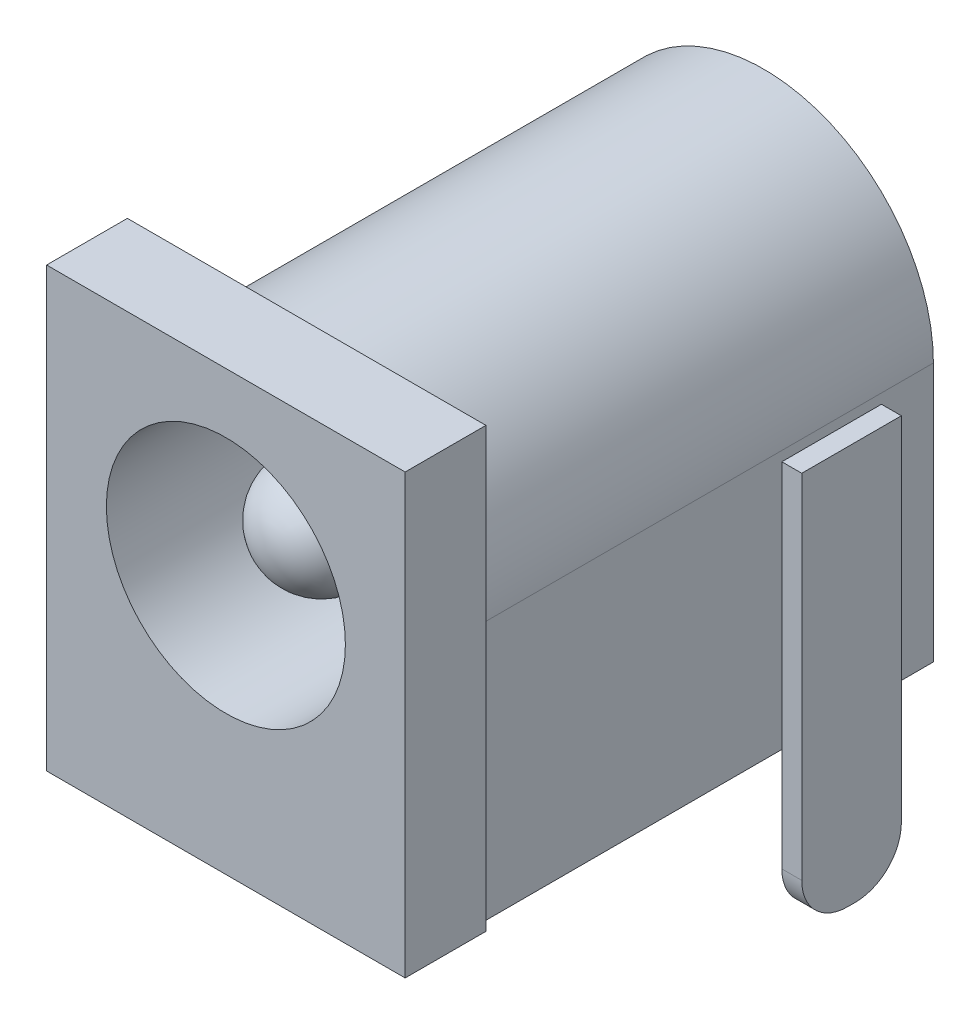
ISO-10303-21;
HEADER;
FILE_DESCRIPTION(('STEP AP214'),'2;1');
FILE_NAME('part.step','',(''),(''),'','','');
FILE_SCHEMA(('AUTOMOTIVE_DESIGN { 1 0 10303 214 1 1 1 1 }'));
ENDSEC;
DATA;
#1=APPLICATION_CONTEXT('core data for automotive mechanical design processes');
#2=APPLICATION_PROTOCOL_DEFINITION('international standard','automotive_design',2000,#1);
#3=PRODUCT_CONTEXT('',#1,'mechanical');
#4=PRODUCT('Part','Part','',(#3));
#5=PRODUCT_RELATED_PRODUCT_CATEGORY('part','',(#4));
#6=PRODUCT_DEFINITION_FORMATION('','',#4);
#7=PRODUCT_DEFINITION_CONTEXT('part definition',#1,'design');
#8=PRODUCT_DEFINITION('design','',#6,#7);
#9=PRODUCT_DEFINITION_SHAPE('','',#8);
#10=(LENGTH_UNIT() NAMED_UNIT(*) SI_UNIT(.MILLI.,.METRE.));
#11=(NAMED_UNIT(*) PLANE_ANGLE_UNIT() SI_UNIT($,.RADIAN.));
#12=(NAMED_UNIT(*) SI_UNIT($,.STERADIAN.) SOLID_ANGLE_UNIT());
#13=UNCERTAINTY_MEASURE_WITH_UNIT(LENGTH_MEASURE(1.E-05),#10,'distance_accuracy_value','');
#14=(GEOMETRIC_REPRESENTATION_CONTEXT(3) GLOBAL_UNCERTAINTY_ASSIGNED_CONTEXT((#13)) GLOBAL_UNIT_ASSIGNED_CONTEXT((#10,
#11,#12)) REPRESENTATION_CONTEXT('',''));
#15=CARTESIAN_POINT('',(0.,0.,0.));
#16=DIRECTION('',(0.,0.,1.));
#17=DIRECTION('',(1.,0.,0.));
#18=AXIS2_PLACEMENT_3D('',#15,#16,#17);
#19=CARTESIAN_POINT('',(9.50543642404111,6.5,1.55));
#20=DIRECTION('',(0.,0.,-1.));
#21=DIRECTION('',(-1.,0.,0.));
#22=AXIS2_PLACEMENT_3D('',#19,#20,#21);
#23=PLANE('',#22);
#24=DIRECTION('',(0.,-1.,0.));
#25=VECTOR('',#24,1.);
#26=CARTESIAN_POINT('',(9.50543642404111,6.5,1.55));
#27=LINE('',#26,#25);
#28=CARTESIAN_POINT('',(9.50543642404111,6.5,1.55));
#29=VERTEX_POINT('',#28);
#30=CARTESIAN_POINT('',(9.50543642404111,-2.35,1.55));
#31=VERTEX_POINT('',#30);
#32=EDGE_CURVE('E132',#29,#31,#27,.T.);
#33=ORIENTED_EDGE('',*,*,#32,.T.);
#34=DIRECTION('',(1.,0.,0.));
#35=VECTOR('',#34,1.);
#36=CARTESIAN_POINT('',(-0.00100000000000894,-2.35,1.55000000000001));
#37=LINE('',#36,#35);
#38=CARTESIAN_POINT('',(9.00543642404111,-2.35,1.55));
#39=VERTEX_POINT('',#38);
#40=EDGE_CURVE('E135',#39,#31,#37,.T.);
#41=ORIENTED_EDGE('',*,*,#40,.F.);
#42=DIRECTION('',(0.,-1.,0.));
#43=VECTOR('',#42,1.);
#44=CARTESIAN_POINT('',(9.00543642404111,6.5,1.55));
#45=LINE('',#44,#43);
#46=CARTESIAN_POINT('',(9.00543642404111,6.5,1.55));
#47=VERTEX_POINT('',#46);
#48=EDGE_CURVE('E47',#47,#39,#45,.T.);
#49=ORIENTED_EDGE('',*,*,#48,.F.);
#50=DIRECTION('',(1.,0.,0.));
#51=VECTOR('',#50,1.);
#52=CARTESIAN_POINT('',(9.50543642404111,6.5,1.55));
#53=LINE('',#52,#51);
#54=EDGE_CURVE('E122',#47,#29,#53,.T.);
#55=ORIENTED_EDGE('',*,*,#54,.T.);
#56=EDGE_LOOP('',(#33,#41,#49,#55));
#57=FACE_BOUND('',#56,.T.);
#58=ADVANCED_FACE('F43',(#57),#23,.T.);
#59=CARTESIAN_POINT('',(9.00543642404111,-3.5,1.55));
#60=DIRECTION('',(0.,1.,0.));
#61=DIRECTION('',(0.,0.,1.));
#62=AXIS2_PLACEMENT_3D('',#59,#60,#61);
#63=PLANE('',#62);
#64=DIRECTION('',(1.,0.,0.));
#65=VECTOR('',#64,1.);
#66=CARTESIAN_POINT('',(-0.00100000000000794,-3.5,2.7));
#67=LINE('',#66,#65);
#68=CARTESIAN_POINT('',(9.00543642404111,-3.5,2.7));
#69=VERTEX_POINT('',#68);
#70=CARTESIAN_POINT('',(9.50543642404111,-3.5,2.7));
#71=VERTEX_POINT('',#70);
#72=EDGE_CURVE('E96',#69,#71,#67,.T.);
#73=ORIENTED_EDGE('',*,*,#72,.T.);
#74=DIRECTION('',(0.,0.,1.));
#75=VECTOR('',#74,1.);
#76=CARTESIAN_POINT('',(9.50543642404111,-3.5,4.05));
#77=LINE('',#76,#75);
#78=CARTESIAN_POINT('',(9.50543642404111,-3.5,2.9));
#79=VERTEX_POINT('',#78);
#80=EDGE_CURVE('E113',#71,#79,#77,.T.);
#81=ORIENTED_EDGE('',*,*,#80,.T.);
#82=DIRECTION('',(1.,0.,0.));
#83=VECTOR('',#82,1.);
#84=CARTESIAN_POINT('',(-0.00100000000000794,-3.5,2.9));
#85=LINE('',#84,#83);
#86=CARTESIAN_POINT('',(9.00543642404111,-3.5,2.9));
#87=VERTEX_POINT('',#86);
#88=EDGE_CURVE('E104',#87,#79,#85,.T.);
#89=ORIENTED_EDGE('',*,*,#88,.F.);
#90=DIRECTION('',(0.,0.,-1.));
#91=VECTOR('',#90,1.);
#92=CARTESIAN_POINT('',(9.00543642404111,-3.5,4.05));
#93=LINE('',#92,#91);
#94=EDGE_CURVE('E109',#87,#69,#93,.T.);
#95=ORIENTED_EDGE('',*,*,#94,.T.);
#96=EDGE_LOOP('',(#73,#81,#89,#95));
#97=FACE_BOUND('',#96,.T.);
#98=ADVANCED_FACE('F112',(#97),#63,.F.);
#99=CARTESIAN_POINT('',(9.00543642404111,6.5,4.05));
#100=DIRECTION('',(-1.,0.,0.));
#101=DIRECTION('',(0.,0.,1.));
#102=AXIS2_PLACEMENT_3D('',#99,#100,#101);
#103=PLANE('',#102);
#104=CARTESIAN_POINT('',(9.00543642404111,-2.35,2.7));
#105=DIRECTION('',(-1.,0.,0.));
#106=DIRECTION('',(0.,0.,1.));
#107=AXIS2_PLACEMENT_3D('',#104,#105,#106);
#108=CIRCLE('',#107,1.15);
#109=EDGE_CURVE('E99',#39,#69,#108,.T.);
#110=ORIENTED_EDGE('',*,*,#109,.T.);
#111=ORIENTED_EDGE('',*,*,#94,.F.);
#112=CARTESIAN_POINT('',(9.00543642404111,-2.35,2.9));
#113=DIRECTION('',(-1.,0.,0.));
#114=DIRECTION('',(0.,0.,1.));
#115=AXIS2_PLACEMENT_3D('',#112,#113,#114);
#116=CIRCLE('',#115,1.15);
#117=CARTESIAN_POINT('',(9.00543642404111,-2.35,4.05));
#118=VERTEX_POINT('',#117);
#119=EDGE_CURVE('E68',#87,#118,#116,.T.);
#120=ORIENTED_EDGE('',*,*,#119,.T.);
#121=DIRECTION('',(0.,-1.,0.));
#122=VECTOR('',#121,1.);
#123=CARTESIAN_POINT('',(9.00543642404111,6.5,4.05));
#124=LINE('',#123,#122);
#125=CARTESIAN_POINT('',(9.00543642404111,6.5,4.05));
#126=VERTEX_POINT('',#125);
#127=EDGE_CURVE('E12',#126,#118,#124,.T.);
#128=ORIENTED_EDGE('',*,*,#127,.F.);
#129=DIRECTION('',(0.,0.,-1.));
#130=VECTOR('',#129,1.);
#131=CARTESIAN_POINT('',(9.00543642404111,6.5,4.05));
#132=LINE('',#131,#130);
#133=EDGE_CURVE('E116',#126,#47,#132,.T.);
#134=ORIENTED_EDGE('',*,*,#133,.T.);
#135=ORIENTED_EDGE('',*,*,#48,.T.);
#136=EDGE_LOOP('',(#110,#111,#120,#128,#134,#135));
#137=FACE_BOUND('',#136,.T.);
#138=ADVANCED_FACE('F45',(#137),#103,.T.);
#139=CARTESIAN_POINT('',(9.50543642404111,6.5,4.05));
#140=DIRECTION('',(0.,0.,1.));
#141=DIRECTION('',(1.,0.,0.));
#142=AXIS2_PLACEMENT_3D('',#139,#140,#141);
#143=PLANE('',#142);
#144=DIRECTION('',(1.,0.,0.));
#145=VECTOR('',#144,1.);
#146=CARTESIAN_POINT('',(-0.00100000000000395,-2.35,4.05000000000002));
#147=LINE('',#146,#145);
#148=CARTESIAN_POINT('',(9.50543642404111,-2.35,4.05));
#149=VERTEX_POINT('',#148);
#150=EDGE_CURVE('E147',#118,#149,#147,.T.);
#151=ORIENTED_EDGE('',*,*,#150,.T.);
#152=DIRECTION('',(0.,-1.,0.));
#153=VECTOR('',#152,1.);
#154=CARTESIAN_POINT('',(9.50543642404111,6.5,4.05));
#155=LINE('',#154,#153);
#156=CARTESIAN_POINT('',(9.50543642404111,6.5,4.05));
#157=VERTEX_POINT('',#156);
#158=EDGE_CURVE('E52',#157,#149,#155,.T.);
#159=ORIENTED_EDGE('',*,*,#158,.F.);
#160=DIRECTION('',(-1.,0.,0.));
#161=VECTOR('',#160,1.);
#162=CARTESIAN_POINT('',(9.50543642404111,6.5,4.05));
#163=LINE('',#162,#161);
#164=EDGE_CURVE('E128',#157,#126,#163,.T.);
#165=ORIENTED_EDGE('',*,*,#164,.T.);
#166=ORIENTED_EDGE('',*,*,#127,.T.);
#167=EDGE_LOOP('',(#151,#159,#165,#166));
#168=FACE_BOUND('',#167,.T.);
#169=ADVANCED_FACE('F146',(#168),#143,.T.);
#170=CARTESIAN_POINT('',(9.50543642404111,6.5,4.05));
#171=DIRECTION('',(1.,0.,0.));
#172=DIRECTION('',(0.,0.,-1.));
#173=AXIS2_PLACEMENT_3D('',#170,#171,#172);
#174=PLANE('',#173);
#175=CARTESIAN_POINT('',(9.50543642404111,-2.35,2.7));
#176=DIRECTION('',(-1.,0.,0.));
#177=DIRECTION('',(0.,0.,-1.));
#178=AXIS2_PLACEMENT_3D('',#175,#176,#177);
#179=CIRCLE('',#178,1.15);
#180=EDGE_CURVE('E60',#31,#71,#179,.T.);
#181=ORIENTED_EDGE('',*,*,#180,.F.);
#182=ORIENTED_EDGE('',*,*,#32,.F.);
#183=DIRECTION('',(0.,0.,1.));
#184=VECTOR('',#183,1.);
#185=CARTESIAN_POINT('',(9.50543642404111,6.5,4.05));
#186=LINE('',#185,#184);
#187=EDGE_CURVE('E125',#29,#157,#186,.T.);
#188=ORIENTED_EDGE('',*,*,#187,.T.);
#189=ORIENTED_EDGE('',*,*,#158,.T.);
#190=CARTESIAN_POINT('',(9.50543642404111,-2.35,2.9));
#191=DIRECTION('',(-1.,0.,0.));
#192=DIRECTION('',(0.,0.,-1.));
#193=AXIS2_PLACEMENT_3D('',#190,#191,#192);
#194=CIRCLE('',#193,1.15);
#195=EDGE_CURVE('E114',#79,#149,#194,.T.);
#196=ORIENTED_EDGE('',*,*,#195,.F.);
#197=ORIENTED_EDGE('',*,*,#80,.F.);
#198=EDGE_LOOP('',(#181,#182,#188,#189,#196,#197));
#199=FACE_BOUND('',#198,.T.);
#200=ADVANCED_FACE('F139',(#199),#174,.T.);
#201=CARTESIAN_POINT('',(9.00543642404111,6.5,1.55));
#202=DIRECTION('',(0.,1.,0.));
#203=DIRECTION('',(0.,0.,1.));
#204=AXIS2_PLACEMENT_3D('',#201,#202,#203);
#205=PLANE('',#204);
#206=ORIENTED_EDGE('',*,*,#133,.F.);
#207=ORIENTED_EDGE('',*,*,#164,.F.);
#208=ORIENTED_EDGE('',*,*,#187,.F.);
#209=ORIENTED_EDGE('',*,*,#54,.F.);
#210=EDGE_LOOP('',(#206,#207,#208,#209));
#211=FACE_BOUND('',#210,.T.);
#212=ADVANCED_FACE('F143',(#211),#205,.T.);
#213=CARTESIAN_POINT('',(-0.00100000000000794,-2.35,2.9));
#214=DIRECTION('',(1.,0.,0.));
#215=DIRECTION('',(0.,0.,-1.));
#216=AXIS2_PLACEMENT_3D('',#213,#214,#215);
#217=CYLINDRICAL_SURFACE('',#216,1.15);
#218=ORIENTED_EDGE('',*,*,#88,.T.);
#219=ORIENTED_EDGE('',*,*,#195,.T.);
#220=ORIENTED_EDGE('',*,*,#150,.F.);
#221=ORIENTED_EDGE('',*,*,#119,.F.);
#222=EDGE_LOOP('',(#218,#219,#220,#221));
#223=FACE_BOUND('',#222,.T.);
#224=ADVANCED_FACE('F149',(#223),#217,.T.);
#225=CARTESIAN_POINT('',(-0.00100000000000794,-2.35,2.7));
#226=DIRECTION('',(1.,0.,0.));
#227=DIRECTION('',(0.,0.,-1.));
#228=AXIS2_PLACEMENT_3D('',#225,#226,#227);
#229=CYLINDRICAL_SURFACE('',#228,1.15);
#230=ORIENTED_EDGE('',*,*,#40,.T.);
#231=ORIENTED_EDGE('',*,*,#180,.T.);
#232=ORIENTED_EDGE('',*,*,#72,.F.);
#233=ORIENTED_EDGE('',*,*,#109,.F.);
#234=EDGE_LOOP('',(#230,#231,#232,#233));
#235=FACE_BOUND('',#234,.T.);
#236=ADVANCED_FACE('F98',(#235),#229,.T.);
#237=CLOSED_SHELL('',(#58,#98,#138,#169,#200,#212,#224,#236));
#238=MANIFOLD_SOLID_BREP('B2',#237);
#239=CARTESIAN_POINT('',(4.5,6.5,3.));
#240=DIRECTION('',(0.,0.,1.));
#241=DIRECTION('',(1.,0.,0.));
#242=AXIS2_PLACEMENT_3D('',#239,#240,#241);
#243=PLANE('',#242);
#244=CARTESIAN_POINT('',(4.5,6.5,3.));
#245=DIRECTION('',(0.,0.,1.));
#246=DIRECTION('',(1.,0.,0.));
#247=AXIS2_PLACEMENT_3D('',#244,#245,#246);
#248=CIRCLE('',#247,3.);
#249=CARTESIAN_POINT('',(7.5,6.5,3.));
#250=VERTEX_POINT('',#249);
#251=EDGE_CURVE('E391',#250,#250,#248,.T.);
#252=ORIENTED_EDGE('',*,*,#251,.T.);
#253=EDGE_LOOP('',(#252));
#254=FACE_BOUND('',#253,.T.);
#255=CARTESIAN_POINT('',(4.5,6.5,3.));
#256=DIRECTION('',(0.,0.,1.));
#257=DIRECTION('',(1.,0.,0.));
#258=AXIS2_PLACEMENT_3D('',#255,#256,#257);
#259=CIRCLE('',#258,1.3411747981982);
#260=CARTESIAN_POINT('',(5.84117479819819,6.5,3.));
#261=VERTEX_POINT('',#260);
#262=EDGE_CURVE('E862',#261,#261,#259,.T.);
#263=ORIENTED_EDGE('',*,*,#262,.F.);
#264=EDGE_LOOP('',(#263));
#265=FACE_BOUND('',#264,.T.);
#266=ADVANCED_FACE('F219',(#254,#265),#243,.T.);
#267=CARTESIAN_POINT('',(3.25,6.5,6.05));
#268=DIRECTION('',(-1.,0.,0.));
#269=DIRECTION('',(0.,0.,1.));
#270=AXIS2_PLACEMENT_3D('',#267,#268,#269);
#271=PLANE('',#270);
#272=DIRECTION('',(0.,-1.,0.));
#273=VECTOR('',#272,1.);
#274=CARTESIAN_POINT('',(3.25,6.5,5.55));
#275=LINE('',#274,#273);
#276=CARTESIAN_POINT('',(3.25,0.,5.55));
#277=VERTEX_POINT('',#276);
#278=CARTESIAN_POINT('',(3.25,-2.35,5.55));
#279=VERTEX_POINT('',#278);
#280=EDGE_CURVE('E430',#277,#279,#275,.T.);
#281=ORIENTED_EDGE('',*,*,#280,.T.);
#282=DIRECTION('',(0.,0.,-1.));
#283=VECTOR('',#282,1.);
#284=CARTESIAN_POINT('',(3.25,-2.35,11.9209561867341));
#285=LINE('',#284,#283);
#286=CARTESIAN_POINT('',(3.25,-2.35,6.05));
#287=VERTEX_POINT('',#286);
#288=EDGE_CURVE('E532',#287,#279,#285,.T.);
#289=ORIENTED_EDGE('',*,*,#288,.F.);
#290=DIRECTION('',(0.,-1.,0.));
#291=VECTOR('',#290,1.);
#292=CARTESIAN_POINT('',(3.25,6.5,6.05));
#293=LINE('',#292,#291);
#294=CARTESIAN_POINT('',(3.25,0.,6.05));
#295=VERTEX_POINT('',#294);
#296=EDGE_CURVE('E432',#295,#287,#293,.T.);
#297=ORIENTED_EDGE('',*,*,#296,.F.);
#298=DIRECTION('',(0.,0.,1.));
#299=VECTOR('',#298,1.);
#300=CARTESIAN_POINT('',(3.25,0.,13.5));
#301=LINE('',#300,#299);
#302=EDGE_CURVE('E497',#277,#295,#301,.T.);
#303=ORIENTED_EDGE('',*,*,#302,.F.);
#304=EDGE_LOOP('',(#281,#289,#297,#303));
#305=FACE_BOUND('',#304,.T.);
#306=ADVANCED_FACE('F599',(#305),#271,.T.);
#307=CARTESIAN_POINT('',(5.75,-3.5,5.55));
#308=DIRECTION('',(0.,1.,0.));
#309=DIRECTION('',(0.,0.,1.));
#310=AXIS2_PLACEMENT_3D('',#307,#308,#309);
#311=PLANE('',#310);
#312=DIRECTION('',(0.,0.,-1.));
#313=VECTOR('',#312,1.);
#314=CARTESIAN_POINT('',(4.4,-3.5,11.9209561867341));
#315=LINE('',#314,#313);
#316=CARTESIAN_POINT('',(4.4,-3.5,6.05));
#317=VERTEX_POINT('',#316);
#318=CARTESIAN_POINT('',(4.4,-3.5,5.55));
#319=VERTEX_POINT('',#318);
#320=EDGE_CURVE('E538',#317,#319,#315,.T.);
#321=ORIENTED_EDGE('',*,*,#320,.T.);
#322=DIRECTION('',(1.,0.,0.));
#323=VECTOR('',#322,1.);
#324=CARTESIAN_POINT('',(5.75,-3.5,5.55));
#325=LINE('',#324,#323);
#326=CARTESIAN_POINT('',(4.6,-3.5,5.55));
#327=VERTEX_POINT('',#326);
#328=EDGE_CURVE('E423',#319,#327,#325,.T.);
#329=ORIENTED_EDGE('',*,*,#328,.T.);
#330=DIRECTION('',(0.,0.,-1.));
#331=VECTOR('',#330,1.);
#332=CARTESIAN_POINT('',(4.6,-3.5,11.9209561867341));
#333=LINE('',#332,#331);
#334=CARTESIAN_POINT('',(4.6,-3.5,6.05));
#335=VERTEX_POINT('',#334);
#336=EDGE_CURVE('E853',#335,#327,#333,.T.);
#337=ORIENTED_EDGE('',*,*,#336,.F.);
#338=DIRECTION('',(-1.,0.,0.));
#339=VECTOR('',#338,1.);
#340=CARTESIAN_POINT('',(5.75,-3.5,6.05));
#341=LINE('',#340,#339);
#342=EDGE_CURVE('E420',#335,#317,#341,.T.);
#343=ORIENTED_EDGE('',*,*,#342,.T.);
#344=EDGE_LOOP('',(#321,#329,#337,#343));
#345=FACE_BOUND('',#344,.T.);
#346=ADVANCED_FACE('F605',(#345),#311,.F.);
#347=CARTESIAN_POINT('',(3.25,6.5,-0.326449713077622));
#348=DIRECTION('',(-1.,0.,0.));
#349=DIRECTION('',(0.,0.,1.));
#350=AXIS2_PLACEMENT_3D('',#347,#348,#349);
#351=PLANE('',#350);
#352=DIRECTION('',(0.,-1.,0.));
#353=VECTOR('',#352,1.);
#354=CARTESIAN_POINT('',(3.25,6.5,-0.326449713077622));
#355=LINE('',#354,#353);
#356=CARTESIAN_POINT('',(3.25,6.5,-0.326449713077622));
#357=VERTEX_POINT('',#356);
#358=CARTESIAN_POINT('',(3.25,-2.35,-0.326449713077622));
#359=VERTEX_POINT('',#358);
#360=EDGE_CURVE('E410',#357,#359,#355,.T.);
#361=ORIENTED_EDGE('',*,*,#360,.T.);
#362=CARTESIAN_POINT('',(3.25,-2.35,0.173550286922378));
#363=VERTEX_POINT('',#362);
#364=EDGE_CURVE('E529',#363,#359,#285,.T.);
#365=ORIENTED_EDGE('',*,*,#364,.F.);
#366=DIRECTION('',(0.,-1.,0.));
#367=VECTOR('',#366,1.);
#368=CARTESIAN_POINT('',(3.25,6.5,0.173550286922379));
#369=LINE('',#368,#367);
#370=CARTESIAN_POINT('',(3.25,0.,0.173550286922379));
#371=VERTEX_POINT('',#370);
#372=EDGE_CURVE('E412',#371,#363,#369,.T.);
#373=ORIENTED_EDGE('',*,*,#372,.F.);
#374=DIRECTION('',(0.,0.,1.));
#375=VECTOR('',#374,1.);
#376=CARTESIAN_POINT('',(3.25,0.,13.5));
#377=LINE('',#376,#375);
#378=CARTESIAN_POINT('',(3.25,0.,0.));
#379=VERTEX_POINT('',#378);
#380=EDGE_CURVE('E409',#379,#371,#377,.T.);
#381=ORIENTED_EDGE('',*,*,#380,.F.);
#382=DIRECTION('',(0.,1.,0.));
#383=VECTOR('',#382,1.);
#384=CARTESIAN_POINT('',(3.25,11.,0.));
#385=LINE('',#384,#383);
#386=CARTESIAN_POINT('',(3.25,6.5,0.));
#387=VERTEX_POINT('',#386);
#388=EDGE_CURVE('E509',#379,#387,#385,.T.);
#389=ORIENTED_EDGE('',*,*,#388,.T.);
#390=DIRECTION('',(0.,0.,-1.));
#391=VECTOR('',#390,1.);
#392=CARTESIAN_POINT('',(3.25,6.5,-0.326449713077622));
#393=LINE('',#392,#391);
#394=EDGE_CURVE('E399',#387,#357,#393,.T.);
#395=ORIENTED_EDGE('',*,*,#394,.T.);
#396=EDGE_LOOP('',(#361,#365,#373,#381,#389,#395));
#397=FACE_BOUND('',#396,.T.);
#398=ADVANCED_FACE('F526',(#397),#351,.T.);
#399=CARTESIAN_POINT('',(5.75,-3.5,0.173550286922379));
#400=DIRECTION('',(0.,-1.,0.));
#401=DIRECTION('',(0.,0.,-1.));
#402=AXIS2_PLACEMENT_3D('',#399,#400,#401);
#403=PLANE('',#402);
#404=DIRECTION('',(0.,0.,-1.));
#405=VECTOR('',#404,1.);
#406=CARTESIAN_POINT('',(4.4,-3.5,11.9209561867341));
#407=LINE('',#406,#405);
#408=CARTESIAN_POINT('',(4.4,-3.5,-0.326449713077622));
#409=VERTEX_POINT('',#408);
#410=CARTESIAN_POINT('',(4.4,-3.5,0.173550286922378));
#411=VERTEX_POINT('',#410);
#412=EDGE_CURVE('E41',#409,#411,#407,.F.);
#413=ORIENTED_EDGE('',*,*,#412,.F.);
#414=DIRECTION('',(1.,0.,0.));
#415=VECTOR('',#414,1.);
#416=CARTESIAN_POINT('',(5.75,-3.5,-0.326449713077622));
#417=LINE('',#416,#415);
#418=CARTESIAN_POINT('',(4.6,-3.5,-0.326449713077622));
#419=VERTEX_POINT('',#418);
#420=EDGE_CURVE('E387',#409,#419,#417,.T.);
#421=ORIENTED_EDGE('',*,*,#420,.T.);
#422=DIRECTION('',(0.,0.,-1.));
#423=VECTOR('',#422,1.);
#424=CARTESIAN_POINT('',(4.6,-3.5,11.9209561867341));
#425=LINE('',#424,#423);
#426=CARTESIAN_POINT('',(4.6,-3.5,0.173550286922379));
#427=VERTEX_POINT('',#426);
#428=EDGE_CURVE('E228',#419,#427,#425,.F.);
#429=ORIENTED_EDGE('',*,*,#428,.T.);
#430=DIRECTION('',(-1.,0.,0.));
#431=VECTOR('',#430,1.);
#432=CARTESIAN_POINT('',(5.75,-3.5,0.173550286922379));
#433=LINE('',#432,#431);
#434=EDGE_CURVE('E396',#427,#411,#433,.T.);
#435=ORIENTED_EDGE('',*,*,#434,.T.);
#436=EDGE_LOOP('',(#413,#421,#429,#435));
#437=FACE_BOUND('',#436,.T.);
#438=ADVANCED_FACE('F394',(#437),#403,.T.);
#439=CARTESIAN_POINT('',(0.,0.,13.5));
#440=DIRECTION('',(1.,0.,0.));
#441=DIRECTION('',(0.,1.,0.));
#442=AXIS2_PLACEMENT_3D('',#439,#440,#441);
#443=PLANE('',#442);
#444=DIRECTION('',(0.,1.,0.));
#445=VECTOR('',#444,1.);
#446=CARTESIAN_POINT('',(0.,0.,11.4721847336654));
#447=LINE('',#446,#445);
#448=CARTESIAN_POINT('',(0.,0.,11.4721847336654));
#449=VERTEX_POINT('',#448);
#450=CARTESIAN_POINT('',(0.,11.,11.4721847336654));
#451=VERTEX_POINT('',#450);
#452=EDGE_CURVE('E465',#449,#451,#447,.T.);
#453=ORIENTED_EDGE('',*,*,#452,.F.);
#454=DIRECTION('',(0.,0.,-1.));
#455=VECTOR('',#454,1.);
#456=CARTESIAN_POINT('',(0.,0.,13.5));
#457=LINE('',#456,#455);
#458=CARTESIAN_POINT('',(0.,0.,13.5));
#459=VERTEX_POINT('',#458);
#460=EDGE_CURVE('E489',#459,#449,#457,.T.);
#461=ORIENTED_EDGE('',*,*,#460,.F.);
#462=DIRECTION('',(0.,-1.,0.));
#463=VECTOR('',#462,1.);
#464=CARTESIAN_POINT('',(0.,0.,13.5));
#465=LINE('',#464,#463);
#466=CARTESIAN_POINT('',(0.,11.,13.5));
#467=VERTEX_POINT('',#466);
#468=EDGE_CURVE('E468',#467,#459,#465,.T.);
#469=ORIENTED_EDGE('',*,*,#468,.F.);
#470=DIRECTION('',(0.,0.,-1.));
#471=VECTOR('',#470,1.);
#472=CARTESIAN_POINT('',(0.,11.,13.5));
#473=LINE('',#472,#471);
#474=EDGE_CURVE('E478',#467,#451,#473,.T.);
#475=ORIENTED_EDGE('',*,*,#474,.T.);
#476=EDGE_LOOP('',(#453,#461,#469,#475));
#477=FACE_BOUND('',#476,.T.);
#478=ADVANCED_FACE('F584',(#477),#443,.F.);
#479=CARTESIAN_POINT('',(0.,0.,13.5));
#480=DIRECTION('',(0.,1.,0.));
#481=DIRECTION('',(0.,0.,1.));
#482=AXIS2_PLACEMENT_3D('',#479,#480,#481);
#483=PLANE('',#482);
#484=DIRECTION('',(1.,0.,0.));
#485=VECTOR('',#484,1.);
#486=CARTESIAN_POINT('',(0.,0.,6.05));
#487=LINE('',#486,#485);
#488=CARTESIAN_POINT('',(5.75,0.,6.05));
#489=VERTEX_POINT('',#488);
#490=EDGE_CURVE('E494',#295,#489,#487,.T.);
#491=ORIENTED_EDGE('',*,*,#490,.T.);
#492=DIRECTION('',(0.,0.,-1.));
#493=VECTOR('',#492,1.);
#494=CARTESIAN_POINT('',(5.75000000000001,0.,13.5));
#495=LINE('',#494,#493);
#496=CARTESIAN_POINT('',(5.75,0.,5.55));
#497=VERTEX_POINT('',#496);
#498=EDGE_CURVE('E503',#489,#497,#495,.T.);
#499=ORIENTED_EDGE('',*,*,#498,.T.);
#500=DIRECTION('',(-1.,0.,0.));
#501=VECTOR('',#500,1.);
#502=CARTESIAN_POINT('',(0.,0.,5.55));
#503=LINE('',#502,#501);
#504=EDGE_CURVE('E500',#497,#277,#503,.T.);
#505=ORIENTED_EDGE('',*,*,#504,.T.);
#506=ORIENTED_EDGE('',*,*,#302,.T.);
#507=EDGE_LOOP('',(#491,#499,#505,#506));
#508=FACE_BOUND('',#507,.T.);
#509=DIRECTION('',(1.,0.,0.));
#510=VECTOR('',#509,1.);
#511=CARTESIAN_POINT('',(0.,0.,0.173550286922378));
#512=LINE('',#511,#510);
#513=CARTESIAN_POINT('',(5.75,0.,0.173550286922379));
#514=VERTEX_POINT('',#513);
#515=EDGE_CURVE('E381',#371,#514,#512,.T.);
#516=ORIENTED_EDGE('',*,*,#515,.T.);
#517=DIRECTION('',(0.,0.,-1.));
#518=VECTOR('',#517,1.);
#519=CARTESIAN_POINT('',(5.75000000000005,0.,13.5));
#520=LINE('',#519,#518);
#521=CARTESIAN_POINT('',(5.75,0.,0.));
#522=VERTEX_POINT('',#521);
#523=EDGE_CURVE('E417',#514,#522,#520,.T.);
#524=ORIENTED_EDGE('',*,*,#523,.T.);
#525=DIRECTION('',(1.,0.,0.));
#526=VECTOR('',#525,1.);
#527=CARTESIAN_POINT('',(0.,0.,0.));
#528=LINE('',#527,#526);
#529=CARTESIAN_POINT('',(8.75986173325592,0.,0.));
#530=VERTEX_POINT('',#529);
#531=EDGE_CURVE('E467',#522,#530,#528,.T.);
#532=ORIENTED_EDGE('',*,*,#531,.T.);
#533=DIRECTION('',(0.,0.,-1.));
#534=VECTOR('',#533,1.);
#535=CARTESIAN_POINT('',(8.75986173325592,0.,11.4721847336654));
#536=LINE('',#535,#534);
#537=CARTESIAN_POINT('',(8.75986173325592,0.,11.4721847336654));
#538=VERTEX_POINT('',#537);
#539=EDGE_CURVE('E447',#538,#530,#536,.T.);
#540=ORIENTED_EDGE('',*,*,#539,.F.);
#541=DIRECTION('',(1.,0.,0.));
#542=VECTOR('',#541,1.);
#543=CARTESIAN_POINT('',(0.,0.,11.4721847336654));
#544=LINE('',#543,#542);
#545=CARTESIAN_POINT('',(9.,0.,11.4721847336654));
#546=VERTEX_POINT('',#545);
#547=EDGE_CURVE('E438',#538,#546,#544,.T.);
#548=ORIENTED_EDGE('',*,*,#547,.T.);
#549=DIRECTION('',(0.,0.,-1.));
#550=VECTOR('',#549,1.);
#551=CARTESIAN_POINT('',(9.,0.,13.5));
#552=LINE('',#551,#550);
#553=CARTESIAN_POINT('',(9.,0.,13.5));
#554=VERTEX_POINT('',#553);
#555=EDGE_CURVE('E486',#554,#546,#552,.T.);
#556=ORIENTED_EDGE('',*,*,#555,.F.);
#557=DIRECTION('',(1.,0.,0.));
#558=VECTOR('',#557,1.);
#559=CARTESIAN_POINT('',(0.,0.,13.5));
#560=LINE('',#559,#558);
#561=EDGE_CURVE('E471',#459,#554,#560,.T.);
#562=ORIENTED_EDGE('',*,*,#561,.F.);
#563=ORIENTED_EDGE('',*,*,#460,.T.);
#564=CARTESIAN_POINT('',(0.24013826674407,0.,11.4721847336654));
#565=VERTEX_POINT('',#564);
#566=EDGE_CURVE('E435',#449,#565,#544,.T.);
#567=ORIENTED_EDGE('',*,*,#566,.T.);
#568=DIRECTION('',(0.,0.,-1.));
#569=VECTOR('',#568,1.);
#570=CARTESIAN_POINT('',(0.24013826674407,0.,11.4721847336654));
#571=LINE('',#570,#569);
#572=CARTESIAN_POINT('',(0.24013826674407,0.,0.));
#573=VERTEX_POINT('',#572);
#574=EDGE_CURVE('E454',#565,#573,#571,.T.);
#575=ORIENTED_EDGE('',*,*,#574,.T.);
#576=EDGE_CURVE('E472',#573,#379,#528,.T.);
#577=ORIENTED_EDGE('',*,*,#576,.T.);
#578=ORIENTED_EDGE('',*,*,#380,.T.);
#579=EDGE_LOOP('',(#516,#524,#532,#540,#548,#556,#562,#563,#567,#575,#577,#578));
#580=FACE_BOUND('',#579,.T.);
#581=ADVANCED_FACE('F516',(#508,#580),#483,.F.);
#582=CARTESIAN_POINT('',(9.,0.,13.5));
#583=DIRECTION('',(-1.,0.,0.));
#584=DIRECTION('',(0.,-1.,0.));
#585=AXIS2_PLACEMENT_3D('',#582,#583,#584);
#586=PLANE('',#585);
#587=DIRECTION('',(0.,-1.,0.));
#588=VECTOR('',#587,1.);
#589=CARTESIAN_POINT('',(9.,0.,11.4721847336654));
#590=LINE('',#589,#588);
#591=CARTESIAN_POINT('',(9.,11.,11.4721847336654));
#592=VERTEX_POINT('',#591);
#593=EDGE_CURVE('E457',#592,#546,#590,.T.);
#594=ORIENTED_EDGE('',*,*,#593,.F.);
#595=DIRECTION('',(0.,0.,-1.));
#596=VECTOR('',#595,1.);
#597=CARTESIAN_POINT('',(9.,11.,13.5));
#598=LINE('',#597,#596);
#599=CARTESIAN_POINT('',(9.,11.,13.5));
#600=VERTEX_POINT('',#599);
#601=EDGE_CURVE('E483',#600,#592,#598,.T.);
#602=ORIENTED_EDGE('',*,*,#601,.F.);
#603=DIRECTION('',(0.,1.,0.));
#604=VECTOR('',#603,1.);
#605=CARTESIAN_POINT('',(9.,0.,13.5));
#606=LINE('',#605,#604);
#607=EDGE_CURVE('E474',#554,#600,#606,.T.);
#608=ORIENTED_EDGE('',*,*,#607,.F.);
#609=ORIENTED_EDGE('',*,*,#555,.T.);
#610=EDGE_LOOP('',(#594,#602,#608,#609));
#611=FACE_BOUND('',#610,.T.);
#612=ADVANCED_FACE('F574',(#611),#586,.F.);
#613=CARTESIAN_POINT('',(0.,11.,13.5));
#614=DIRECTION('',(0.,-1.,0.));
#615=DIRECTION('',(0.,0.,-1.));
#616=AXIS2_PLACEMENT_3D('',#613,#614,#615);
#617=PLANE('',#616);
#618=DIRECTION('',(1.,0.,0.));
#619=VECTOR('',#618,1.);
#620=CARTESIAN_POINT('',(0.,11.,11.4721847336654));
#621=LINE('',#620,#619);
#622=EDGE_CURVE('E492',#451,#592,#621,.T.);
#623=ORIENTED_EDGE('',*,*,#622,.F.);
#624=ORIENTED_EDGE('',*,*,#474,.F.);
#625=DIRECTION('',(-1.,0.,0.));
#626=VECTOR('',#625,1.);
#627=CARTESIAN_POINT('',(0.,11.,13.5));
#628=LINE('',#627,#626);
#629=EDGE_CURVE('E476',#600,#467,#628,.T.);
#630=ORIENTED_EDGE('',*,*,#629,.F.);
#631=ORIENTED_EDGE('',*,*,#601,.T.);
#632=EDGE_LOOP('',(#623,#624,#630,#631));
#633=FACE_BOUND('',#632,.T.);
#634=ADVANCED_FACE('F587',(#633),#617,.F.);
#635=CARTESIAN_POINT('',(0.,11.,13.5));
#636=DIRECTION('',(0.,0.,-1.));
#637=DIRECTION('',(-1.,0.,0.));
#638=AXIS2_PLACEMENT_3D('',#635,#636,#637);
#639=PLANE('',#638);
#640=CARTESIAN_POINT('',(4.5,6.5,13.5));
#641=DIRECTION('',(0.,0.,1.));
#642=DIRECTION('',(1.,0.,0.));
#643=AXIS2_PLACEMENT_3D('',#640,#641,#642);
#644=CIRCLE('',#643,3.);
#645=CARTESIAN_POINT('',(7.5,6.5,13.5));
#646=VERTEX_POINT('',#645);
#647=EDGE_CURVE('E858',#646,#646,#644,.T.);
#648=ORIENTED_EDGE('',*,*,#647,.F.);
#649=EDGE_LOOP('',(#648));
#650=FACE_BOUND('',#649,.T.);
#651=ORIENTED_EDGE('',*,*,#468,.T.);
#652=ORIENTED_EDGE('',*,*,#561,.T.);
#653=ORIENTED_EDGE('',*,*,#607,.T.);
#654=ORIENTED_EDGE('',*,*,#629,.T.);
#655=EDGE_LOOP('',(#651,#652,#653,#654));
#656=FACE_BOUND('',#655,.T.);
#657=ADVANCED_FACE('F578',(#650,#656),#639,.F.);
#658=CARTESIAN_POINT('',(0.,11.,0.));
#659=DIRECTION('',(0.,0.,-1.));
#660=DIRECTION('',(-1.,0.,0.));
#661=AXIS2_PLACEMENT_3D('',#658,#659,#660);
#662=PLANE('',#661);
#663=DIRECTION('',(0.,-1.,0.));
#664=VECTOR('',#663,1.);
#665=CARTESIAN_POINT('',(5.75,11.,0.));
#666=LINE('',#665,#664);
#667=CARTESIAN_POINT('',(5.75,6.5,0.));
#668=VERTEX_POINT('',#667);
#669=EDGE_CURVE('E512',#668,#522,#666,.T.);
#670=ORIENTED_EDGE('',*,*,#669,.F.);
#671=DIRECTION('',(-1.,0.,0.));
#672=VECTOR('',#671,1.);
#673=CARTESIAN_POINT('',(0.,6.5,0.));
#674=LINE('',#673,#672);
#675=EDGE_CURVE('E506',#668,#387,#674,.T.);
#676=ORIENTED_EDGE('',*,*,#675,.T.);
#677=ORIENTED_EDGE('',*,*,#388,.F.);
#678=ORIENTED_EDGE('',*,*,#576,.F.);
#679=DIRECTION('',(0.,-1.,0.));
#680=VECTOR('',#679,1.);
#681=CARTESIAN_POINT('',(0.24013826674407,0.,0.));
#682=LINE('',#681,#680);
#683=CARTESIAN_POINT('',(0.240138266744069,6.5,0.));
#684=VERTEX_POINT('',#683);
#685=EDGE_CURVE('E439',#684,#573,#682,.T.);
#686=ORIENTED_EDGE('',*,*,#685,.F.);
#687=CARTESIAN_POINT('',(4.5,6.5,0.));
#688=DIRECTION('',(0.,0.,-1.));
#689=DIRECTION('',(-1.,0.,0.));
#690=AXIS2_PLACEMENT_3D('',#687,#688,#689);
#691=CIRCLE('',#690,4.25986173325593);
#692=CARTESIAN_POINT('',(8.75986173325592,6.5,0.));
#693=VERTEX_POINT('',#692);
#694=EDGE_CURVE('E450',#684,#693,#691,.T.);
#695=ORIENTED_EDGE('',*,*,#694,.T.);
#696=DIRECTION('',(0.,-1.,0.));
#697=VECTOR('',#696,1.);
#698=CARTESIAN_POINT('',(8.75986173325592,0.,0.));
#699=LINE('',#698,#697);
#700=EDGE_CURVE('E429',#693,#530,#699,.T.);
#701=ORIENTED_EDGE('',*,*,#700,.T.);
#702=ORIENTED_EDGE('',*,*,#531,.F.);
#703=EDGE_LOOP('',(#670,#676,#677,#678,#686,#695,#701,#702));
#704=FACE_BOUND('',#703,.T.);
#705=ADVANCED_FACE('F558',(#704),#662,.T.);
#706=CARTESIAN_POINT('',(0.,0.,11.4721847336654));
#707=DIRECTION('',(0.,0.,-1.));
#708=DIRECTION('',(-1.,0.,0.));
#709=AXIS2_PLACEMENT_3D('',#706,#707,#708);
#710=PLANE('',#709);
#711=ORIENTED_EDGE('',*,*,#452,.T.);
#712=ORIENTED_EDGE('',*,*,#622,.T.);
#713=ORIENTED_EDGE('',*,*,#593,.T.);
#714=ORIENTED_EDGE('',*,*,#547,.F.);
#715=DIRECTION('',(0.,-1.,0.));
#716=VECTOR('',#715,1.);
#717=CARTESIAN_POINT('',(8.75986173325592,0.,11.4721847336654));
#718=LINE('',#717,#716);
#719=CARTESIAN_POINT('',(8.75986173325592,6.5,11.4721847336654));
#720=VERTEX_POINT('',#719);
#721=EDGE_CURVE('E440',#720,#538,#718,.T.);
#722=ORIENTED_EDGE('',*,*,#721,.F.);
#723=CARTESIAN_POINT('',(4.5,6.5,11.4721847336654));
#724=DIRECTION('',(0.,0.,-1.));
#725=DIRECTION('',(-1.,0.,0.));
#726=AXIS2_PLACEMENT_3D('',#723,#724,#725);
#727=CIRCLE('',#726,4.25986173325593);
#728=CARTESIAN_POINT('',(0.240138266744069,6.5,11.4721847336654));
#729=VERTEX_POINT('',#728);
#730=EDGE_CURVE('E442',#729,#720,#727,.T.);
#731=ORIENTED_EDGE('',*,*,#730,.F.);
#732=DIRECTION('',(0.,-1.,0.));
#733=VECTOR('',#732,1.);
#734=CARTESIAN_POINT('',(0.24013826674407,0.,11.4721847336654));
#735=LINE('',#734,#733);
#736=EDGE_CURVE('E444',#729,#565,#735,.T.);
#737=ORIENTED_EDGE('',*,*,#736,.T.);
#738=ORIENTED_EDGE('',*,*,#566,.F.);
#739=EDGE_LOOP('',(#711,#712,#713,#714,#722,#731,#737,#738));
#740=FACE_BOUND('',#739,.T.);
#741=ADVANCED_FACE('F569',(#740),#710,.T.);
#742=CARTESIAN_POINT('',(0.24013826674407,0.,11.4721847336654));
#743=DIRECTION('',(1.,0.,0.));
#744=DIRECTION('',(0.,1.,0.));
#745=AXIS2_PLACEMENT_3D('',#742,#743,#744);
#746=PLANE('',#745);
#747=ORIENTED_EDGE('',*,*,#685,.T.);
#748=ORIENTED_EDGE('',*,*,#574,.F.);
#749=ORIENTED_EDGE('',*,*,#736,.F.);
#750=DIRECTION('',(0.,0.,-1.));
#751=VECTOR('',#750,1.);
#752=CARTESIAN_POINT('',(0.240138266744069,6.5,11.4721847336654));
#753=LINE('',#752,#751);
#754=EDGE_CURVE('E458',#729,#684,#753,.T.);
#755=ORIENTED_EDGE('',*,*,#754,.T.);
#756=EDGE_LOOP('',(#747,#748,#749,#755));
#757=FACE_BOUND('',#756,.T.);
#758=ADVANCED_FACE('F652',(#757),#746,.F.);
#759=CARTESIAN_POINT('',(4.5,6.5,11.4721847336654));
#760=DIRECTION('',(0.,0.,-1.));
#761=DIRECTION('',(-1.,0.,0.));
#762=AXIS2_PLACEMENT_3D('',#759,#760,#761);
#763=CYLINDRICAL_SURFACE('',#762,4.25986173325593);
#764=ORIENTED_EDGE('',*,*,#694,.F.);
#765=ORIENTED_EDGE('',*,*,#754,.F.);
#766=ORIENTED_EDGE('',*,*,#730,.T.);
#767=DIRECTION('',(0.,0.,-1.));
#768=VECTOR('',#767,1.);
#769=CARTESIAN_POINT('',(8.75986173325592,6.5,11.4721847336654));
#770=LINE('',#769,#768);
#771=EDGE_CURVE('E460',#720,#693,#770,.T.);
#772=ORIENTED_EDGE('',*,*,#771,.T.);
#773=EDGE_LOOP('',(#764,#765,#766,#772));
#774=FACE_BOUND('',#773,.T.);
#775=ADVANCED_FACE('F655',(#774),#763,.T.);
#776=CARTESIAN_POINT('',(8.75986173325592,0.,11.4721847336654));
#777=DIRECTION('',(1.,0.,0.));
#778=DIRECTION('',(0.,0.,-1.));
#779=AXIS2_PLACEMENT_3D('',#776,#777,#778);
#780=PLANE('',#779);
#781=ORIENTED_EDGE('',*,*,#700,.F.);
#782=ORIENTED_EDGE('',*,*,#771,.F.);
#783=ORIENTED_EDGE('',*,*,#721,.T.);
#784=ORIENTED_EDGE('',*,*,#539,.T.);
#785=EDGE_LOOP('',(#781,#782,#783,#784));
#786=FACE_BOUND('',#785,.T.);
#787=ADVANCED_FACE('F563',(#786),#780,.T.);
#788=CARTESIAN_POINT('',(5.75,6.5,6.05));
#789=DIRECTION('',(1.,0.,0.));
#790=DIRECTION('',(0.,0.,-1.));
#791=AXIS2_PLACEMENT_3D('',#788,#789,#790);
#792=PLANE('',#791);
#793=DIRECTION('',(0.,-1.,0.));
#794=VECTOR('',#793,1.);
#795=CARTESIAN_POINT('',(5.75,6.5,6.05));
#796=LINE('',#795,#794);
#797=CARTESIAN_POINT('',(5.75,-2.35,6.05));
#798=VERTEX_POINT('',#797);
#799=EDGE_CURVE('E426',#489,#798,#796,.T.);
#800=ORIENTED_EDGE('',*,*,#799,.T.);
#801=DIRECTION('',(0.,0.,-1.));
#802=VECTOR('',#801,1.);
#803=CARTESIAN_POINT('',(5.75,-2.35,11.9209561867341));
#804=LINE('',#803,#802);
#805=CARTESIAN_POINT('',(5.75,-2.35,5.55));
#806=VERTEX_POINT('',#805);
#807=EDGE_CURVE('E540',#798,#806,#804,.T.);
#808=ORIENTED_EDGE('',*,*,#807,.T.);
#809=DIRECTION('',(0.,-1.,0.));
#810=VECTOR('',#809,1.);
#811=CARTESIAN_POINT('',(5.75,6.5,5.55));
#812=LINE('',#811,#810);
#813=EDGE_CURVE('E427',#497,#806,#812,.T.);
#814=ORIENTED_EDGE('',*,*,#813,.F.);
#815=ORIENTED_EDGE('',*,*,#498,.F.);
#816=EDGE_LOOP('',(#800,#808,#814,#815));
#817=FACE_BOUND('',#816,.T.);
#818=ADVANCED_FACE('F641',(#817),#792,.T.);
#819=CARTESIAN_POINT('',(5.75,6.5,5.55));
#820=DIRECTION('',(0.,0.,-1.));
#821=DIRECTION('',(-1.,0.,0.));
#822=AXIS2_PLACEMENT_3D('',#819,#820,#821);
#823=PLANE('',#822);
#824=CARTESIAN_POINT('',(4.4,-2.35,5.55));
#825=DIRECTION('',(0.,0.,-1.));
#826=DIRECTION('',(-1.,0.,0.));
#827=AXIS2_PLACEMENT_3D('',#824,#825,#826);
#828=CIRCLE('',#827,1.15);
#829=EDGE_CURVE('E235',#279,#319,#828,.F.);
#830=ORIENTED_EDGE('',*,*,#829,.F.);
#831=ORIENTED_EDGE('',*,*,#280,.F.);
#832=ORIENTED_EDGE('',*,*,#504,.F.);
#833=ORIENTED_EDGE('',*,*,#813,.T.);
#834=CARTESIAN_POINT('',(4.6,-2.35,5.55));
#835=DIRECTION('',(0.,0.,-1.));
#836=DIRECTION('',(-1.,0.,0.));
#837=AXIS2_PLACEMENT_3D('',#834,#835,#836);
#838=CIRCLE('',#837,1.15);
#839=EDGE_CURVE('E545',#327,#806,#838,.F.);
#840=ORIENTED_EDGE('',*,*,#839,.F.);
#841=ORIENTED_EDGE('',*,*,#328,.F.);
#842=EDGE_LOOP('',(#830,#831,#832,#833,#840,#841));
#843=FACE_BOUND('',#842,.T.);
#844=ADVANCED_FACE('F639',(#843),#823,.T.);
#845=CARTESIAN_POINT('',(5.75,6.5,6.05));
#846=DIRECTION('',(0.,0.,1.));
#847=DIRECTION('',(1.,0.,0.));
#848=AXIS2_PLACEMENT_3D('',#845,#846,#847);
#849=PLANE('',#848);
#850=CARTESIAN_POINT('',(4.4,-2.35,6.05));
#851=DIRECTION('',(0.,0.,1.));
#852=DIRECTION('',(1.,0.,0.));
#853=AXIS2_PLACEMENT_3D('',#850,#851,#852);
#854=CIRCLE('',#853,1.15);
#855=EDGE_CURVE('E534',#287,#317,#854,.T.);
#856=ORIENTED_EDGE('',*,*,#855,.T.);
#857=ORIENTED_EDGE('',*,*,#342,.F.);
#858=CARTESIAN_POINT('',(4.6,-2.35,6.05));
#859=DIRECTION('',(0.,0.,1.));
#860=DIRECTION('',(1.,0.,0.));
#861=AXIS2_PLACEMENT_3D('',#858,#859,#860);
#862=CIRCLE('',#861,1.15);
#863=EDGE_CURVE('E243',#335,#798,#862,.T.);
#864=ORIENTED_EDGE('',*,*,#863,.T.);
#865=ORIENTED_EDGE('',*,*,#799,.F.);
#866=ORIENTED_EDGE('',*,*,#490,.F.);
#867=ORIENTED_EDGE('',*,*,#296,.T.);
#868=EDGE_LOOP('',(#856,#857,#864,#865,#866,#867));
#869=FACE_BOUND('',#868,.T.);
#870=ADVANCED_FACE('F633',(#869),#849,.T.);
#871=CARTESIAN_POINT('',(5.75,6.5,0.173550286922379));
#872=DIRECTION('',(0.,0.,1.));
#873=DIRECTION('',(1.,0.,0.));
#874=AXIS2_PLACEMENT_3D('',#871,#872,#873);
#875=PLANE('',#874);
#876=CARTESIAN_POINT('',(4.4,-2.35,0.173550286922378));
#877=DIRECTION('',(0.,0.,1.));
#878=DIRECTION('',(1.,0.,0.));
#879=AXIS2_PLACEMENT_3D('',#876,#877,#878);
#880=CIRCLE('',#879,1.15);
#881=EDGE_CURVE('E548',#411,#363,#880,.F.);
#882=ORIENTED_EDGE('',*,*,#881,.F.);
#883=ORIENTED_EDGE('',*,*,#434,.F.);
#884=CARTESIAN_POINT('',(4.6,-2.35,0.173550286922378));
#885=DIRECTION('',(0.,0.,1.));
#886=DIRECTION('',(1.,0.,0.));
#887=AXIS2_PLACEMENT_3D('',#884,#885,#886);
#888=CIRCLE('',#887,1.15);
#889=CARTESIAN_POINT('',(5.75,-2.35,0.173550286922378));
#890=VERTEX_POINT('',#889);
#891=EDGE_CURVE('E376',#890,#427,#888,.F.);
#892=ORIENTED_EDGE('',*,*,#891,.F.);
#893=DIRECTION('',(0.,-1.,0.));
#894=VECTOR('',#893,1.);
#895=CARTESIAN_POINT('',(5.75,6.5,0.173550286922379));
#896=LINE('',#895,#894);
#897=EDGE_CURVE('E407',#514,#890,#896,.T.);
#898=ORIENTED_EDGE('',*,*,#897,.F.);
#899=ORIENTED_EDGE('',*,*,#515,.F.);
#900=ORIENTED_EDGE('',*,*,#372,.T.);
#901=EDGE_LOOP('',(#882,#883,#892,#898,#899,#900));
#902=FACE_BOUND('',#901,.T.);
#903=ADVANCED_FACE('F522',(#902),#875,.T.);
#904=CARTESIAN_POINT('',(5.75,6.5,-0.326449713077622));
#905=DIRECTION('',(1.,0.,0.));
#906=DIRECTION('',(0.,0.,-1.));
#907=AXIS2_PLACEMENT_3D('',#904,#905,#906);
#908=PLANE('',#907);
#909=ORIENTED_EDGE('',*,*,#897,.T.);
#910=CARTESIAN_POINT('',(5.75,-2.35,-0.326449713077622));
#911=VERTEX_POINT('',#910);
#912=EDGE_CURVE('E543',#890,#911,#804,.T.);
#913=ORIENTED_EDGE('',*,*,#912,.T.);
#914=DIRECTION('',(0.,-1.,0.));
#915=VECTOR('',#914,1.);
#916=CARTESIAN_POINT('',(5.75,6.5,-0.326449713077622));
#917=LINE('',#916,#915);
#918=CARTESIAN_POINT('',(5.75,6.5,-0.326449713077622));
#919=VERTEX_POINT('',#918);
#920=EDGE_CURVE('E389',#919,#911,#917,.T.);
#921=ORIENTED_EDGE('',*,*,#920,.F.);
#922=DIRECTION('',(0.,0.,1.));
#923=VECTOR('',#922,1.);
#924=CARTESIAN_POINT('',(5.75,6.5,-0.326449713077622));
#925=LINE('',#924,#923);
#926=EDGE_CURVE('E395',#919,#668,#925,.T.);
#927=ORIENTED_EDGE('',*,*,#926,.T.);
#928=ORIENTED_EDGE('',*,*,#669,.T.);
#929=ORIENTED_EDGE('',*,*,#523,.F.);
#930=EDGE_LOOP('',(#909,#913,#921,#927,#928,#929));
#931=FACE_BOUND('',#930,.T.);
#932=ADVANCED_FACE('F556',(#931),#908,.T.);
#933=CARTESIAN_POINT('',(5.75,6.5,-0.326449713077622));
#934=DIRECTION('',(0.,0.,-1.));
#935=DIRECTION('',(-1.,0.,0.));
#936=AXIS2_PLACEMENT_3D('',#933,#934,#935);
#937=PLANE('',#936);
#938=CARTESIAN_POINT('',(4.4,-2.35,-0.326449713077622));
#939=DIRECTION('',(0.,0.,1.));
#940=DIRECTION('',(-1.,0.,0.));
#941=AXIS2_PLACEMENT_3D('',#938,#939,#940);
#942=CIRCLE('',#941,1.15);
#943=EDGE_CURVE('E390',#359,#409,#942,.T.);
#944=ORIENTED_EDGE('',*,*,#943,.F.);
#945=ORIENTED_EDGE('',*,*,#360,.F.);
#946=DIRECTION('',(1.,0.,0.));
#947=VECTOR('',#946,1.);
#948=CARTESIAN_POINT('',(5.75,6.5,-0.326449713077622));
#949=LINE('',#948,#947);
#950=EDGE_CURVE('E405',#357,#919,#949,.T.);
#951=ORIENTED_EDGE('',*,*,#950,.T.);
#952=ORIENTED_EDGE('',*,*,#920,.T.);
#953=CARTESIAN_POINT('',(4.6,-2.35,-0.326449713077622));
#954=DIRECTION('',(0.,0.,1.));
#955=DIRECTION('',(-1.,0.,0.));
#956=AXIS2_PLACEMENT_3D('',#953,#954,#955);
#957=CIRCLE('',#956,1.15);
#958=EDGE_CURVE('E373',#419,#911,#957,.T.);
#959=ORIENTED_EDGE('',*,*,#958,.F.);
#960=ORIENTED_EDGE('',*,*,#420,.F.);
#961=EDGE_LOOP('',(#944,#945,#951,#952,#959,#960));
#962=FACE_BOUND('',#961,.T.);
#963=ADVANCED_FACE('F386',(#962),#937,.T.);
#964=CARTESIAN_POINT('',(5.75,6.5,0.173550286922379));
#965=DIRECTION('',(0.,-1.,0.));
#966=DIRECTION('',(0.,0.,-1.));
#967=AXIS2_PLACEMENT_3D('',#964,#965,#966);
#968=PLANE('',#967);
#969=ORIENTED_EDGE('',*,*,#675,.F.);
#970=ORIENTED_EDGE('',*,*,#926,.F.);
#971=ORIENTED_EDGE('',*,*,#950,.F.);
#972=ORIENTED_EDGE('',*,*,#394,.F.);
#973=EDGE_LOOP('',(#969,#970,#971,#972));
#974=FACE_BOUND('',#973,.T.);
#975=ADVANCED_FACE('F553',(#974),#968,.F.);
#976=CARTESIAN_POINT('',(4.6,-2.35,11.9209561867341));
#977=DIRECTION('',(0.,0.,-1.));
#978=DIRECTION('',(-1.,0.,0.));
#979=AXIS2_PLACEMENT_3D('',#976,#977,#978);
#980=CYLINDRICAL_SURFACE('',#979,1.15);
#981=ORIENTED_EDGE('',*,*,#891,.T.);
#982=ORIENTED_EDGE('',*,*,#428,.F.);
#983=ORIENTED_EDGE('',*,*,#958,.T.);
#984=ORIENTED_EDGE('',*,*,#912,.F.);
#985=EDGE_LOOP('',(#981,#982,#983,#984));
#986=FACE_BOUND('',#985,.T.);
#987=ADVANCED_FACE('F371',(#986),#980,.T.);
#988=CARTESIAN_POINT('',(4.4,-2.35,11.9209561867341));
#989=DIRECTION('',(0.,0.,-1.));
#990=DIRECTION('',(-1.,0.,0.));
#991=AXIS2_PLACEMENT_3D('',#988,#989,#990);
#992=CYLINDRICAL_SURFACE('',#991,1.15);
#993=ORIENTED_EDGE('',*,*,#881,.T.);
#994=ORIENTED_EDGE('',*,*,#364,.T.);
#995=ORIENTED_EDGE('',*,*,#943,.T.);
#996=ORIENTED_EDGE('',*,*,#412,.T.);
#997=EDGE_LOOP('',(#993,#994,#995,#996));
#998=FACE_BOUND('',#997,.T.);
#999=ADVANCED_FACE('F549',(#998),#992,.T.);
#1000=ORIENTED_EDGE('',*,*,#839,.T.);
#1001=ORIENTED_EDGE('',*,*,#807,.F.);
#1002=ORIENTED_EDGE('',*,*,#863,.F.);
#1003=ORIENTED_EDGE('',*,*,#336,.T.);
#1004=EDGE_LOOP('',(#1000,#1001,#1002,#1003));
#1005=FACE_BOUND('',#1004,.T.);
#1006=ADVANCED_FACE('F620',(#1005),#980,.T.);
#1007=ORIENTED_EDGE('',*,*,#829,.T.);
#1008=ORIENTED_EDGE('',*,*,#320,.F.);
#1009=ORIENTED_EDGE('',*,*,#855,.F.);
#1010=ORIENTED_EDGE('',*,*,#288,.T.);
#1011=EDGE_LOOP('',(#1007,#1008,#1009,#1010));
#1012=FACE_BOUND('',#1011,.T.);
#1013=ADVANCED_FACE('F616',(#1012),#992,.T.);
#1014=CARTESIAN_POINT('',(4.5,6.5,3.));
#1015=DIRECTION('',(0.,0.,1.));
#1016=DIRECTION('',(1.,0.,0.));
#1017=AXIS2_PLACEMENT_3D('',#1014,#1015,#1016);
#1018=CYLINDRICAL_SURFACE('',#1017,3.);
#1019=ORIENTED_EDGE('',*,*,#251,.F.);
#1020=EDGE_LOOP('',(#1019));
#1021=FACE_BOUND('',#1020,.T.);
#1022=ORIENTED_EDGE('',*,*,#647,.T.);
#1023=EDGE_LOOP('',(#1022));
#1024=FACE_BOUND('',#1023,.T.);
#1025=ADVANCED_FACE('F613',(#1021,#1024),#1018,.F.);
#1026=CARTESIAN_POINT('',(4.5,6.5,11.5));
#1027=DIRECTION('',(0.,0.,-1.));
#1028=DIRECTION('',(-1.,0.,0.));
#1029=AXIS2_PLACEMENT_3D('',#1026,#1027,#1028);
#1030=CYLINDRICAL_SURFACE('',#1029,1.3411747981982);
#1031=CARTESIAN_POINT('',(4.5,6.5,11.5));
#1032=DIRECTION('',(0.,0.,1.));
#1033=DIRECTION('',(1.,0.,0.));
#1034=AXIS2_PLACEMENT_3D('',#1031,#1032,#1033);
#1035=CIRCLE('',#1034,1.3411747981982);
#1036=CARTESIAN_POINT('',(5.84117479819819,6.5,11.5));
#1037=VERTEX_POINT('',#1036);
#1038=EDGE_CURVE('E223',#1037,#1037,#1035,.T.);
#1039=ORIENTED_EDGE('',*,*,#1038,.F.);
#1040=EDGE_LOOP('',(#1039));
#1041=FACE_BOUND('',#1040,.T.);
#1042=ORIENTED_EDGE('',*,*,#262,.T.);
#1043=EDGE_LOOP('',(#1042));
#1044=FACE_BOUND('',#1043,.T.);
#1045=ADVANCED_FACE('F612',(#1041,#1044),#1030,.T.);
#1046=CARTESIAN_POINT('',(4.5,6.5,11.100625080339));
#1047=DIRECTION('',(0.,0.,1.));
#1048=DIRECTION('',(1.,0.,0.));
#1049=AXIS2_PLACEMENT_3D('',#1046,#1047,#1048);
#1050=SPHERICAL_SURFACE('',#1049,1.39937491966099);
#1051=ORIENTED_EDGE('',*,*,#1038,.T.);
#1052=EDGE_LOOP('',(#1051));
#1053=FACE_BOUND('',#1052,.T.);
#1054=ADVANCED_FACE('F221',(#1053),#1050,.T.);
#1055=CLOSED_SHELL('',(#266,#306,#346,#398,#438,#478,#581,#612,#634,#657,#705,#741,#758,#775,
#787,#818,#844,#870,#903,#932,#963,#975,#987,#999,#1006,#1013,#1025,#1045,#1054));
#1056=MANIFOLD_SOLID_BREP('B6',#1055);
#1057=ADVANCED_BREP_SHAPE_REPRESENTATION('',(#18,#238,#1056),#14);
#1058=SHAPE_DEFINITION_REPRESENTATION(#9,#1057);
ENDSEC;
END-ISO-10303-21;
